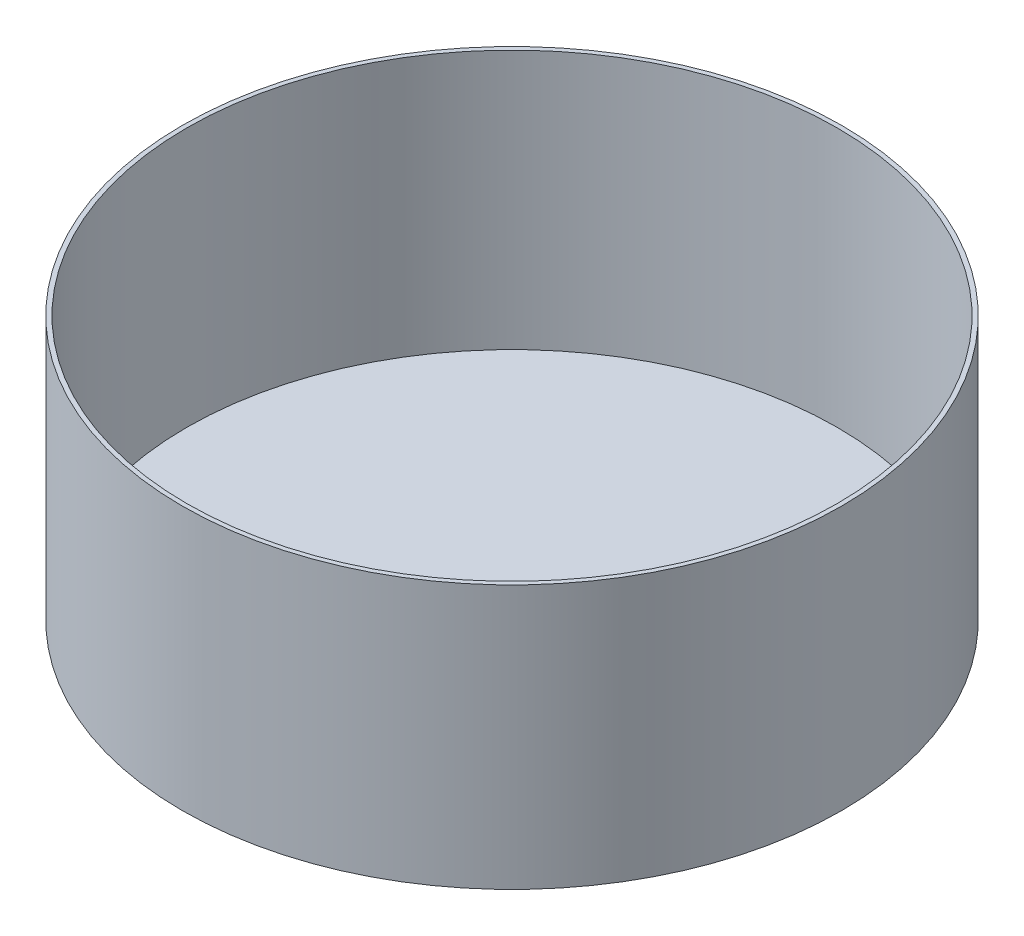
ISO-10303-21;
HEADER;
FILE_DESCRIPTION(('STEP AP214'),'2;1');
FILE_NAME('part.step','',(''),(''),'','','');
FILE_SCHEMA(('AUTOMOTIVE_DESIGN { 1 0 10303 214 1 1 1 1 }'));
ENDSEC;
DATA;
#1=APPLICATION_CONTEXT('core data for automotive mechanical design processes');
#2=APPLICATION_PROTOCOL_DEFINITION('international standard','automotive_design',2000,#1);
#3=PRODUCT_CONTEXT('',#1,'mechanical');
#4=PRODUCT('Part','Part','',(#3));
#5=PRODUCT_RELATED_PRODUCT_CATEGORY('part','',(#4));
#6=PRODUCT_DEFINITION_FORMATION('','',#4);
#7=PRODUCT_DEFINITION_CONTEXT('part definition',#1,'design');
#8=PRODUCT_DEFINITION('design','',#6,#7);
#9=PRODUCT_DEFINITION_SHAPE('','',#8);
#10=(LENGTH_UNIT() NAMED_UNIT(*) SI_UNIT(.MILLI.,.METRE.));
#11=(NAMED_UNIT(*) PLANE_ANGLE_UNIT() SI_UNIT($,.RADIAN.));
#12=(NAMED_UNIT(*) SI_UNIT($,.STERADIAN.) SOLID_ANGLE_UNIT());
#13=UNCERTAINTY_MEASURE_WITH_UNIT(LENGTH_MEASURE(1.E-05),#10,'distance_accuracy_value','');
#14=(GEOMETRIC_REPRESENTATION_CONTEXT(3) GLOBAL_UNCERTAINTY_ASSIGNED_CONTEXT((#13)) GLOBAL_UNIT_ASSIGNED_CONTEXT((#10,
#11,#12)) REPRESENTATION_CONTEXT('',''));
#15=CARTESIAN_POINT('',(0.,0.,0.));
#16=DIRECTION('',(0.,0.,1.));
#17=DIRECTION('',(1.,0.,0.));
#18=AXIS2_PLACEMENT_3D('',#15,#16,#17);
#19=CARTESIAN_POINT('',(0.,600.,0.));
#20=DIRECTION('',(0.,-1.,0.));
#21=DIRECTION('',(0.,0.,-1.));
#22=AXIS2_PLACEMENT_3D('',#19,#20,#21);
#23=CYLINDRICAL_SURFACE('',#22,750.);
#24=CARTESIAN_POINT('',(0.,600.,0.));
#25=DIRECTION('',(0.,1.,0.));
#26=DIRECTION('',(0.,0.,1.));
#27=AXIS2_PLACEMENT_3D('',#24,#25,#26);
#28=CIRCLE('',#27,750.);
#29=CARTESIAN_POINT('',(0.,600.,750.));
#30=VERTEX_POINT('',#29);
#31=EDGE_CURVE('E10',#30,#30,#28,.T.);
#32=ORIENTED_EDGE('',*,*,#31,.F.);
#33=EDGE_LOOP('',(#32));
#34=FACE_BOUND('',#33,.T.);
#35=CARTESIAN_POINT('',(0.,0.,0.));
#36=DIRECTION('',(0.,1.,0.));
#37=DIRECTION('',(0.,0.,1.));
#38=AXIS2_PLACEMENT_3D('',#35,#36,#37);
#39=CIRCLE('',#38,750.);
#40=CARTESIAN_POINT('',(0.,0.,750.));
#41=VERTEX_POINT('',#40);
#42=EDGE_CURVE('E40',#41,#41,#39,.T.);
#43=ORIENTED_EDGE('',*,*,#42,.T.);
#44=EDGE_LOOP('',(#43));
#45=FACE_BOUND('',#44,.T.);
#46=ADVANCED_FACE('F37',(#34,#45),#23,.T.);
#47=CARTESIAN_POINT('',(0.,600.,0.));
#48=DIRECTION('',(0.,1.,0.));
#49=DIRECTION('',(0.,0.,1.));
#50=AXIS2_PLACEMENT_3D('',#47,#48,#49);
#51=PLANE('',#50);
#52=CARTESIAN_POINT('',(0.,600.,0.));
#53=DIRECTION('',(0.,1.,0.));
#54=DIRECTION('',(0.,0.,1.));
#55=AXIS2_PLACEMENT_3D('',#52,#53,#54);
#56=CIRCLE('',#55,740.);
#57=CARTESIAN_POINT('',(0.,600.,740.));
#58=VERTEX_POINT('',#57);
#59=EDGE_CURVE('E47',#58,#58,#56,.T.);
#60=ORIENTED_EDGE('',*,*,#59,.F.);
#61=EDGE_LOOP('',(#60));
#62=FACE_BOUND('',#61,.T.);
#63=ORIENTED_EDGE('',*,*,#31,.T.);
#64=EDGE_LOOP('',(#63));
#65=FACE_BOUND('',#64,.T.);
#66=ADVANCED_FACE('F67',(#62,#65),#51,.T.);
#67=CARTESIAN_POINT('',(0.,0.,0.));
#68=DIRECTION('',(0.,1.,0.));
#69=DIRECTION('',(0.,0.,1.));
#70=AXIS2_PLACEMENT_3D('',#67,#68,#69);
#71=PLANE('',#70);
#72=ORIENTED_EDGE('',*,*,#42,.F.);
#73=EDGE_LOOP('',(#72));
#74=FACE_BOUND('',#73,.T.);
#75=ADVANCED_FACE('F59',(#74),#71,.F.);
#76=CARTESIAN_POINT('',(0.,600.,0.));
#77=DIRECTION('',(0.,-1.,0.));
#78=DIRECTION('',(0.,0.,-1.));
#79=AXIS2_PLACEMENT_3D('',#76,#77,#78);
#80=CYLINDRICAL_SURFACE('',#79,740.);
#81=ORIENTED_EDGE('',*,*,#59,.T.);
#82=EDGE_LOOP('',(#81));
#83=FACE_BOUND('',#82,.T.);
#84=CARTESIAN_POINT('',(0.,10.,0.));
#85=DIRECTION('',(0.,1.,0.));
#86=DIRECTION('',(0.,0.,1.));
#87=AXIS2_PLACEMENT_3D('',#84,#85,#86);
#88=CIRCLE('',#87,740.);
#89=CARTESIAN_POINT('',(0.,10.,740.));
#90=VERTEX_POINT('',#89);
#91=EDGE_CURVE('E51',#90,#90,#88,.T.);
#92=ORIENTED_EDGE('',*,*,#91,.F.);
#93=EDGE_LOOP('',(#92));
#94=FACE_BOUND('',#93,.T.);
#95=ADVANCED_FACE('F57',(#83,#94),#80,.F.);
#96=CARTESIAN_POINT('',(0.,10.,0.));
#97=DIRECTION('',(0.,1.,0.));
#98=DIRECTION('',(0.,0.,1.));
#99=AXIS2_PLACEMENT_3D('',#96,#97,#98);
#100=PLANE('',#99);
#101=ORIENTED_EDGE('',*,*,#91,.T.);
#102=EDGE_LOOP('',(#101));
#103=FACE_BOUND('',#102,.T.);
#104=ADVANCED_FACE('F55',(#103),#100,.T.);
#105=CLOSED_SHELL('',(#46,#66,#75,#95,#104));
#106=MANIFOLD_SOLID_BREP('B2',#105);
#107=ADVANCED_BREP_SHAPE_REPRESENTATION('',(#18,#106),#14);
#108=SHAPE_DEFINITION_REPRESENTATION(#9,#107);
ENDSEC;
END-ISO-10303-21;
